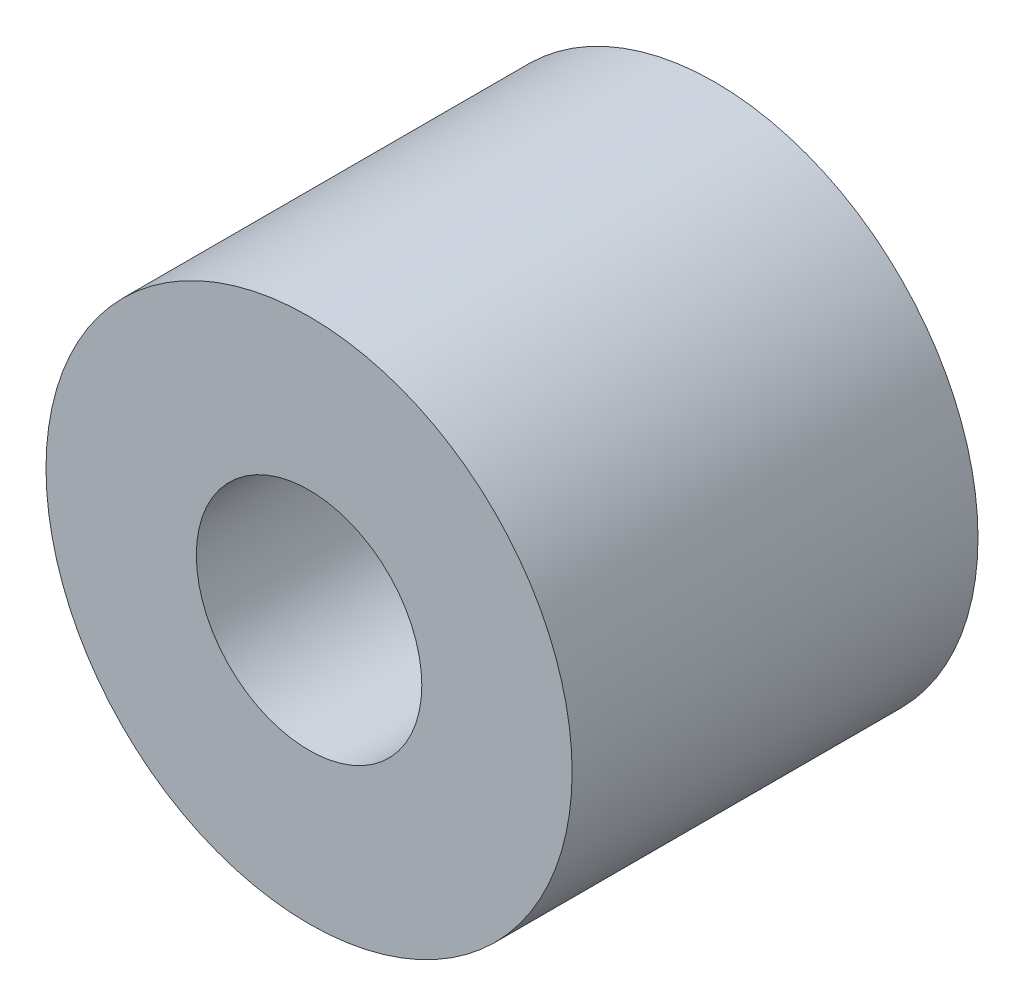
ISO-10303-21;
HEADER;
FILE_DESCRIPTION(('STEP AP214'),'2;1');
FILE_NAME('part.step','',(''),(''),'','','');
FILE_SCHEMA(('AUTOMOTIVE_DESIGN { 1 0 10303 214 1 1 1 1 }'));
ENDSEC;
DATA;
#1=APPLICATION_CONTEXT('core data for automotive mechanical design processes');
#2=APPLICATION_PROTOCOL_DEFINITION('international standard','automotive_design',2000,#1);
#3=PRODUCT_CONTEXT('',#1,'mechanical');
#4=PRODUCT('Part','Part','',(#3));
#5=PRODUCT_RELATED_PRODUCT_CATEGORY('part','',(#4));
#6=PRODUCT_DEFINITION_FORMATION('','',#4);
#7=PRODUCT_DEFINITION_CONTEXT('part definition',#1,'design');
#8=PRODUCT_DEFINITION('design','',#6,#7);
#9=PRODUCT_DEFINITION_SHAPE('','',#8);
#10=(LENGTH_UNIT() NAMED_UNIT(*) SI_UNIT(.MILLI.,.METRE.));
#11=(NAMED_UNIT(*) PLANE_ANGLE_UNIT() SI_UNIT($,.RADIAN.));
#12=(NAMED_UNIT(*) SI_UNIT($,.STERADIAN.) SOLID_ANGLE_UNIT());
#13=UNCERTAINTY_MEASURE_WITH_UNIT(LENGTH_MEASURE(1.E-05),#10,'distance_accuracy_value','');
#14=(GEOMETRIC_REPRESENTATION_CONTEXT(3) GLOBAL_UNCERTAINTY_ASSIGNED_CONTEXT((#13)) GLOBAL_UNIT_ASSIGNED_CONTEXT((#10,
#11,#12)) REPRESENTATION_CONTEXT('',''));
#15=CARTESIAN_POINT('',(0.,0.,0.));
#16=DIRECTION('',(0.,0.,1.));
#17=DIRECTION('',(1.,0.,0.));
#18=AXIS2_PLACEMENT_3D('',#15,#16,#17);
#19=CARTESIAN_POINT('',(0.,0.,5.4));
#20=DIRECTION('',(0.,0.,1.));
#21=DIRECTION('',(1.,0.,0.));
#22=AXIS2_PLACEMENT_3D('',#19,#20,#21);
#23=PLANE('',#22);
#24=CARTESIAN_POINT('',(0.,0.,5.4));
#25=DIRECTION('',(0.,0.,1.));
#26=DIRECTION('',(1.,0.,0.));
#27=AXIS2_PLACEMENT_3D('',#24,#25,#26);
#28=CIRCLE('',#27,3.5);
#29=CARTESIAN_POINT('',(3.5,0.,5.4));
#30=VERTEX_POINT('',#29);
#31=EDGE_CURVE('E10',#30,#30,#28,.T.);
#32=ORIENTED_EDGE('',*,*,#31,.T.);
#33=EDGE_LOOP('',(#32));
#34=FACE_BOUND('',#33,.T.);
#35=CARTESIAN_POINT('',(0.,0.,5.4));
#36=DIRECTION('',(0.,0.,1.));
#37=DIRECTION('',(1.,0.,0.));
#38=AXIS2_PLACEMENT_3D('',#35,#36,#37);
#39=CIRCLE('',#38,1.5);
#40=CARTESIAN_POINT('',(1.5,0.,5.4));
#41=VERTEX_POINT('',#40);
#42=EDGE_CURVE('E47',#41,#41,#39,.T.);
#43=ORIENTED_EDGE('',*,*,#42,.F.);
#44=EDGE_LOOP('',(#43));
#45=FACE_BOUND('',#44,.T.);
#46=ADVANCED_FACE('F36',(#34,#45),#23,.T.);
#47=CARTESIAN_POINT('',(0.,0.,0.));
#48=DIRECTION('',(0.,0.,1.));
#49=DIRECTION('',(1.,0.,0.));
#50=AXIS2_PLACEMENT_3D('',#47,#48,#49);
#51=PLANE('',#50);
#52=CARTESIAN_POINT('',(0.,0.,0.));
#53=DIRECTION('',(0.,0.,1.));
#54=DIRECTION('',(1.,0.,0.));
#55=AXIS2_PLACEMENT_3D('',#52,#53,#54);
#56=CIRCLE('',#55,3.5);
#57=CARTESIAN_POINT('',(3.5,0.,0.));
#58=VERTEX_POINT('',#57);
#59=EDGE_CURVE('E40',#58,#58,#56,.T.);
#60=ORIENTED_EDGE('',*,*,#59,.F.);
#61=EDGE_LOOP('',(#60));
#62=FACE_BOUND('',#61,.T.);
#63=CARTESIAN_POINT('',(0.,0.,0.));
#64=DIRECTION('',(0.,0.,1.));
#65=DIRECTION('',(1.,0.,0.));
#66=AXIS2_PLACEMENT_3D('',#63,#64,#65);
#67=CIRCLE('',#66,1.5);
#68=CARTESIAN_POINT('',(1.5,0.,0.));
#69=VERTEX_POINT('',#68);
#70=EDGE_CURVE('E49',#69,#69,#67,.T.);
#71=ORIENTED_EDGE('',*,*,#70,.T.);
#72=EDGE_LOOP('',(#71));
#73=FACE_BOUND('',#72,.T.);
#74=ADVANCED_FACE('F59',(#62,#73),#51,.F.);
#75=CARTESIAN_POINT('',(0.,0.,5.4));
#76=DIRECTION('',(0.,0.,-1.));
#77=DIRECTION('',(-1.,0.,0.));
#78=AXIS2_PLACEMENT_3D('',#75,#76,#77);
#79=CYLINDRICAL_SURFACE('',#78,3.5);
#80=ORIENTED_EDGE('',*,*,#31,.F.);
#81=EDGE_LOOP('',(#80));
#82=FACE_BOUND('',#81,.T.);
#83=ORIENTED_EDGE('',*,*,#59,.T.);
#84=EDGE_LOOP('',(#83));
#85=FACE_BOUND('',#84,.T.);
#86=ADVANCED_FACE('F38',(#82,#85),#79,.T.);
#87=CARTESIAN_POINT('',(0.,0.,5.4));
#88=DIRECTION('',(0.,0.,-1.));
#89=DIRECTION('',(-1.,0.,0.));
#90=AXIS2_PLACEMENT_3D('',#87,#88,#89);
#91=CYLINDRICAL_SURFACE('',#90,1.5);
#92=ORIENTED_EDGE('',*,*,#42,.T.);
#93=EDGE_LOOP('',(#92));
#94=FACE_BOUND('',#93,.T.);
#95=ORIENTED_EDGE('',*,*,#70,.F.);
#96=EDGE_LOOP('',(#95));
#97=FACE_BOUND('',#96,.T.);
#98=ADVANCED_FACE('F55',(#94,#97),#91,.F.);
#99=CLOSED_SHELL('',(#46,#74,#86,#98));
#100=MANIFOLD_SOLID_BREP('B2',#99);
#101=ADVANCED_BREP_SHAPE_REPRESENTATION('',(#18,#100),#14);
#102=SHAPE_DEFINITION_REPRESENTATION(#9,#101);
ENDSEC;
END-ISO-10303-21;
